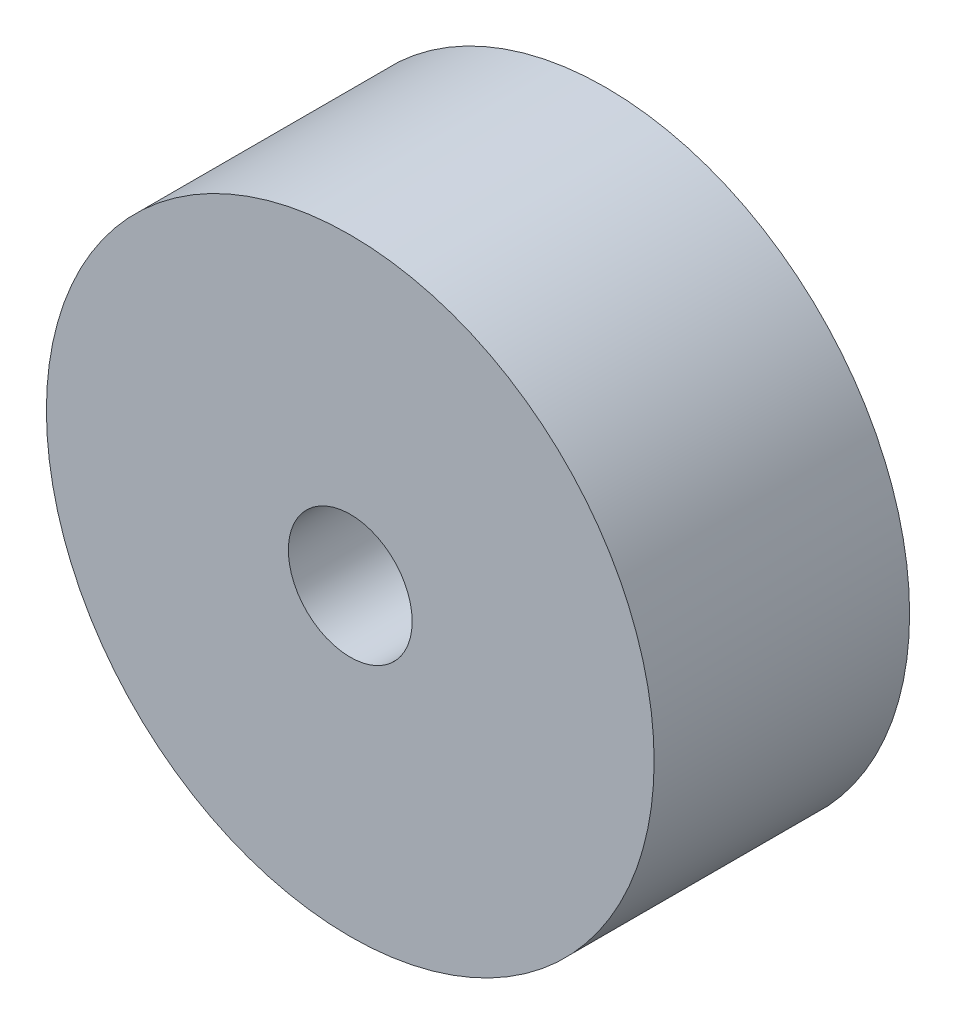
ISO-10303-21;
HEADER;
FILE_DESCRIPTION(('STEP AP214'),'2;1');
FILE_NAME('part.step','',(''),(''),'','','');
FILE_SCHEMA(('AUTOMOTIVE_DESIGN { 1 0 10303 214 1 1 1 1 }'));
ENDSEC;
DATA;
#1=APPLICATION_CONTEXT('core data for automotive mechanical design processes');
#2=APPLICATION_PROTOCOL_DEFINITION('international standard','automotive_design',2000,#1);
#3=PRODUCT_CONTEXT('',#1,'mechanical');
#4=PRODUCT('Part','Part','',(#3));
#5=PRODUCT_RELATED_PRODUCT_CATEGORY('part','',(#4));
#6=PRODUCT_DEFINITION_FORMATION('','',#4);
#7=PRODUCT_DEFINITION_CONTEXT('part definition',#1,'design');
#8=PRODUCT_DEFINITION('design','',#6,#7);
#9=PRODUCT_DEFINITION_SHAPE('','',#8);
#10=(LENGTH_UNIT() NAMED_UNIT(*) SI_UNIT(.MILLI.,.METRE.));
#11=(NAMED_UNIT(*) PLANE_ANGLE_UNIT() SI_UNIT($,.RADIAN.));
#12=(NAMED_UNIT(*) SI_UNIT($,.STERADIAN.) SOLID_ANGLE_UNIT());
#13=UNCERTAINTY_MEASURE_WITH_UNIT(LENGTH_MEASURE(1.E-05),#10,'distance_accuracy_value','');
#14=(GEOMETRIC_REPRESENTATION_CONTEXT(3) GLOBAL_UNCERTAINTY_ASSIGNED_CONTEXT((#13)) GLOBAL_UNIT_ASSIGNED_CONTEXT((#10,
#11,#12)) REPRESENTATION_CONTEXT('',''));
#15=CARTESIAN_POINT('',(0.,0.,0.));
#16=DIRECTION('',(0.,0.,1.));
#17=DIRECTION('',(1.,0.,0.));
#18=AXIS2_PLACEMENT_3D('',#15,#16,#17);
#19=CARTESIAN_POINT('',(0.,0.,10.11));
#20=DIRECTION('',(0.,0.,-1.));
#21=DIRECTION('',(-1.,0.,0.));
#22=AXIS2_PLACEMENT_3D('',#19,#20,#21);
#23=CYLINDRICAL_SURFACE('',#22,12.025);
#24=CARTESIAN_POINT('',(0.,0.,10.11));
#25=DIRECTION('',(0.,0.,1.));
#26=DIRECTION('',(1.,0.,0.));
#27=AXIS2_PLACEMENT_3D('',#24,#25,#26);
#28=CIRCLE('',#27,12.025);
#29=CARTESIAN_POINT('',(12.025,0.,10.11));
#30=VERTEX_POINT('',#29);
#31=EDGE_CURVE('E10',#30,#30,#28,.T.);
#32=ORIENTED_EDGE('',*,*,#31,.F.);
#33=EDGE_LOOP('',(#32));
#34=FACE_BOUND('',#33,.T.);
#35=CARTESIAN_POINT('',(0.,0.,0.));
#36=DIRECTION('',(0.,0.,1.));
#37=DIRECTION('',(1.,0.,0.));
#38=AXIS2_PLACEMENT_3D('',#35,#36,#37);
#39=CIRCLE('',#38,12.025);
#40=CARTESIAN_POINT('',(12.025,0.,0.));
#41=VERTEX_POINT('',#40);
#42=EDGE_CURVE('E34',#41,#41,#39,.T.);
#43=ORIENTED_EDGE('',*,*,#42,.T.);
#44=EDGE_LOOP('',(#43));
#45=FACE_BOUND('',#44,.T.);
#46=ADVANCED_FACE('F31',(#34,#45),#23,.T.);
#47=CARTESIAN_POINT('',(0.,0.,10.11));
#48=DIRECTION('',(0.,0.,1.));
#49=DIRECTION('',(1.,0.,0.));
#50=AXIS2_PLACEMENT_3D('',#47,#48,#49);
#51=PLANE('',#50);
#52=CARTESIAN_POINT('',(0.,0.,10.11));
#53=DIRECTION('',(0.,0.,1.));
#54=DIRECTION('',(1.,0.,0.));
#55=AXIS2_PLACEMENT_3D('',#52,#53,#54);
#56=CIRCLE('',#55,2.45);
#57=CARTESIAN_POINT('',(2.45,0.,10.11));
#58=VERTEX_POINT('',#57);
#59=EDGE_CURVE('E43',#58,#58,#56,.T.);
#60=ORIENTED_EDGE('',*,*,#59,.F.);
#61=EDGE_LOOP('',(#60));
#62=FACE_BOUND('',#61,.T.);
#63=ORIENTED_EDGE('',*,*,#31,.T.);
#64=EDGE_LOOP('',(#63));
#65=FACE_BOUND('',#64,.T.);
#66=ADVANCED_FACE('F58',(#62,#65),#51,.T.);
#67=CARTESIAN_POINT('',(0.,0.,0.));
#68=DIRECTION('',(0.,0.,1.));
#69=DIRECTION('',(1.,0.,0.));
#70=AXIS2_PLACEMENT_3D('',#67,#68,#69);
#71=PLANE('',#70);
#72=CARTESIAN_POINT('',(0.,0.,0.));
#73=DIRECTION('',(0.,0.,1.));
#74=DIRECTION('',(1.,0.,0.));
#75=AXIS2_PLACEMENT_3D('',#72,#73,#74);
#76=CIRCLE('',#75,2.45);
#77=CARTESIAN_POINT('',(2.45,0.,0.));
#78=VERTEX_POINT('',#77);
#79=EDGE_CURVE('E41',#78,#78,#76,.T.);
#80=ORIENTED_EDGE('',*,*,#79,.T.);
#81=EDGE_LOOP('',(#80));
#82=FACE_BOUND('',#81,.T.);
#83=ORIENTED_EDGE('',*,*,#42,.F.);
#84=EDGE_LOOP('',(#83));
#85=FACE_BOUND('',#84,.T.);
#86=ADVANCED_FACE('F49',(#82,#85),#71,.F.);
#87=CARTESIAN_POINT('',(0.,0.,0.));
#88=DIRECTION('',(0.,0.,1.));
#89=DIRECTION('',(1.,0.,0.));
#90=AXIS2_PLACEMENT_3D('',#87,#88,#89);
#91=CYLINDRICAL_SURFACE('',#90,2.45);
#92=ORIENTED_EDGE('',*,*,#79,.F.);
#93=EDGE_LOOP('',(#92));
#94=FACE_BOUND('',#93,.T.);
#95=ORIENTED_EDGE('',*,*,#59,.T.);
#96=EDGE_LOOP('',(#95));
#97=FACE_BOUND('',#96,.T.);
#98=ADVANCED_FACE('F52',(#94,#97),#91,.F.);
#99=CLOSED_SHELL('',(#46,#66,#86,#98));
#100=MANIFOLD_SOLID_BREP('B2',#99);
#101=ADVANCED_BREP_SHAPE_REPRESENTATION('',(#18,#100),#14);
#102=SHAPE_DEFINITION_REPRESENTATION(#9,#101);
ENDSEC;
END-ISO-10303-21;
